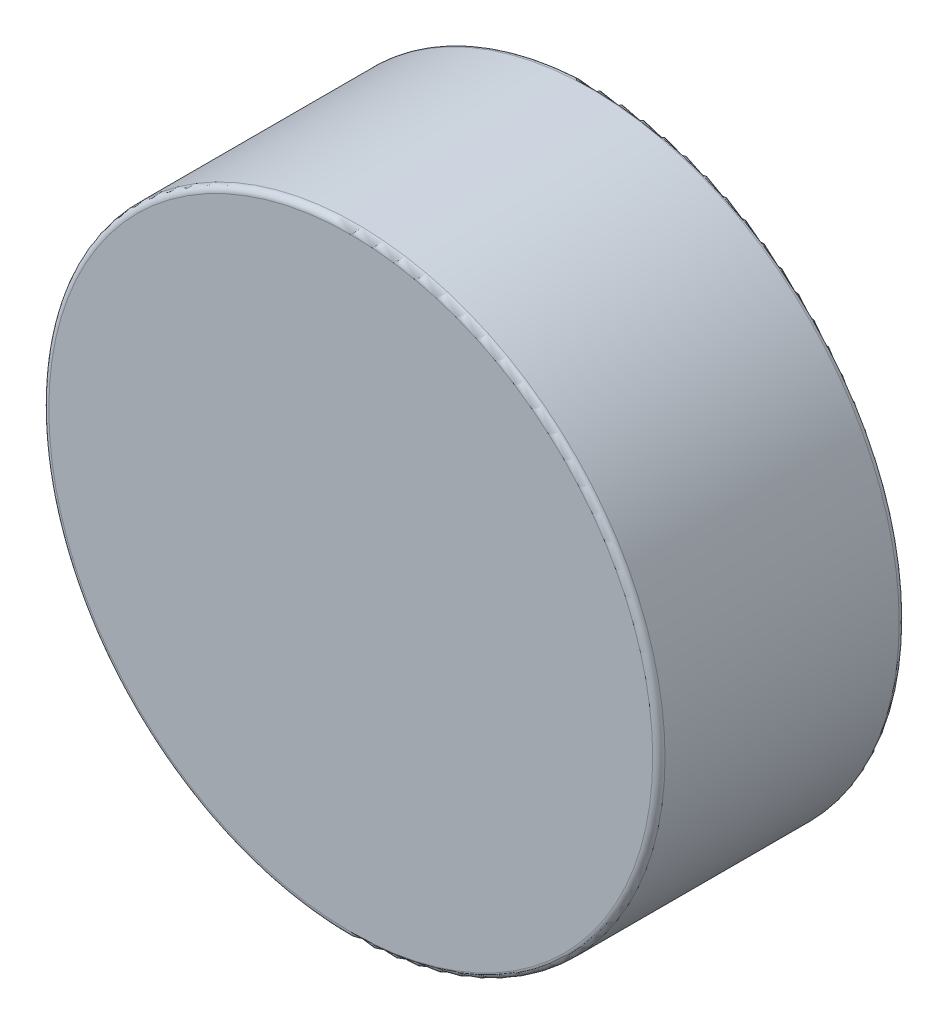
ISO-10303-21;
HEADER;
FILE_DESCRIPTION(('STEP AP214'),'2;1');
FILE_NAME('part.step','',(''),(''),'','','');
FILE_SCHEMA(('AUTOMOTIVE_DESIGN { 1 0 10303 214 1 1 1 1 }'));
ENDSEC;
DATA;
#1=APPLICATION_CONTEXT('core data for automotive mechanical design processes');
#2=APPLICATION_PROTOCOL_DEFINITION('international standard','automotive_design',2000,#1);
#3=PRODUCT_CONTEXT('',#1,'mechanical');
#4=PRODUCT('Part','Part','',(#3));
#5=PRODUCT_RELATED_PRODUCT_CATEGORY('part','',(#4));
#6=PRODUCT_DEFINITION_FORMATION('','',#4);
#7=PRODUCT_DEFINITION_CONTEXT('part definition',#1,'design');
#8=PRODUCT_DEFINITION('design','',#6,#7);
#9=PRODUCT_DEFINITION_SHAPE('','',#8);
#10=(LENGTH_UNIT() NAMED_UNIT(*) SI_UNIT(.MILLI.,.METRE.));
#11=(NAMED_UNIT(*) PLANE_ANGLE_UNIT() SI_UNIT($,.RADIAN.));
#12=(NAMED_UNIT(*) SI_UNIT($,.STERADIAN.) SOLID_ANGLE_UNIT());
#13=UNCERTAINTY_MEASURE_WITH_UNIT(LENGTH_MEASURE(1.E-05),#10,'distance_accuracy_value','');
#14=(GEOMETRIC_REPRESENTATION_CONTEXT(3) GLOBAL_UNCERTAINTY_ASSIGNED_CONTEXT((#13)) GLOBAL_UNIT_ASSIGNED_CONTEXT((#10,
#11,#12)) REPRESENTATION_CONTEXT('',''));
#15=CARTESIAN_POINT('',(0.,0.,0.));
#16=DIRECTION('',(0.,0.,1.));
#17=DIRECTION('',(1.,0.,0.));
#18=AXIS2_PLACEMENT_3D('',#15,#16,#17);
#19=CARTESIAN_POINT('',(0.,0.,1.27));
#20=DIRECTION('',(0.,0.,-1.));
#21=DIRECTION('',(-1.,0.,0.));
#22=AXIS2_PLACEMENT_3D('',#19,#20,#21);
#23=CYLINDRICAL_SURFACE('',#22,3.175);
#24=CARTESIAN_POINT('',(0.,0.,-1.2065));
#25=DIRECTION('',(0.,0.,1.));
#26=DIRECTION('',(1.,0.,0.));
#27=AXIS2_PLACEMENT_3D('',#24,#25,#26);
#28=CIRCLE('',#27,3.175);
#29=CARTESIAN_POINT('',(3.175,0.,-1.2065));
#30=VERTEX_POINT('',#29);
#31=EDGE_CURVE('E52',#30,#30,#28,.T.);
#32=ORIENTED_EDGE('',*,*,#31,.T.);
#33=EDGE_LOOP('',(#32));
#34=FACE_BOUND('',#33,.T.);
#35=CARTESIAN_POINT('',(0.,0.,1.2065));
#36=DIRECTION('',(0.,0.,1.));
#37=DIRECTION('',(1.,0.,0.));
#38=AXIS2_PLACEMENT_3D('',#35,#36,#37);
#39=CIRCLE('',#38,3.175);
#40=CARTESIAN_POINT('',(3.175,0.,1.2065));
#41=VERTEX_POINT('',#40);
#42=EDGE_CURVE('E57',#41,#41,#39,.F.);
#43=ORIENTED_EDGE('',*,*,#42,.T.);
#44=EDGE_LOOP('',(#43));
#45=FACE_BOUND('',#44,.T.);
#46=ADVANCED_FACE('F39',(#34,#45),#23,.T.);
#47=CARTESIAN_POINT('',(0.,0.,1.27));
#48=DIRECTION('',(0.,0.,1.));
#49=DIRECTION('',(1.,0.,0.));
#50=AXIS2_PLACEMENT_3D('',#47,#48,#49);
#51=PLANE('',#50);
#52=CARTESIAN_POINT('',(0.,0.,1.27));
#53=DIRECTION('',(0.,0.,1.));
#54=DIRECTION('',(1.,0.,0.));
#55=AXIS2_PLACEMENT_3D('',#52,#53,#54);
#56=CIRCLE('',#55,3.1115);
#57=CARTESIAN_POINT('',(3.1115,0.,1.27));
#58=VERTEX_POINT('',#57);
#59=EDGE_CURVE('E10',#58,#58,#56,.T.);
#60=ORIENTED_EDGE('',*,*,#59,.T.);
#61=EDGE_LOOP('',(#60));
#62=FACE_BOUND('',#61,.T.);
#63=ADVANCED_FACE('F74',(#62),#51,.T.);
#64=CARTESIAN_POINT('',(0.,0.,-1.27));
#65=DIRECTION('',(0.,0.,1.));
#66=DIRECTION('',(1.,0.,0.));
#67=AXIS2_PLACEMENT_3D('',#64,#65,#66);
#68=PLANE('',#67);
#69=CARTESIAN_POINT('',(0.,0.,-1.27));
#70=DIRECTION('',(0.,0.,1.));
#71=DIRECTION('',(1.,0.,0.));
#72=AXIS2_PLACEMENT_3D('',#69,#70,#71);
#73=CIRCLE('',#72,3.1115);
#74=CARTESIAN_POINT('',(3.1115,0.,-1.27));
#75=VERTEX_POINT('',#74);
#76=EDGE_CURVE('E47',#75,#75,#73,.F.);
#77=ORIENTED_EDGE('',*,*,#76,.T.);
#78=EDGE_LOOP('',(#77));
#79=FACE_BOUND('',#78,.T.);
#80=ADVANCED_FACE('F71',(#79),#68,.F.);
#81=CARTESIAN_POINT('',(0.,0.,-1.2065));
#82=DIRECTION('',(0.,0.,1.));
#83=DIRECTION('',(1.,0.,0.));
#84=AXIS2_PLACEMENT_3D('',#81,#82,#83);
#85=TOROIDAL_SURFACE('',#84,3.1115,0.0635);
#86=ORIENTED_EDGE('',*,*,#76,.F.);
#87=EDGE_LOOP('',(#86));
#88=FACE_BOUND('',#87,.T.);
#89=ORIENTED_EDGE('',*,*,#31,.F.);
#90=EDGE_LOOP('',(#89));
#91=FACE_BOUND('',#90,.T.);
#92=ADVANCED_FACE('F67',(#88,#91),#85,.T.);
#93=CARTESIAN_POINT('',(0.,0.,1.2065));
#94=DIRECTION('',(0.,0.,1.));
#95=DIRECTION('',(1.,0.,0.));
#96=AXIS2_PLACEMENT_3D('',#93,#94,#95);
#97=TOROIDAL_SURFACE('',#96,3.1115,0.0635);
#98=ORIENTED_EDGE('',*,*,#42,.F.);
#99=EDGE_LOOP('',(#98));
#100=FACE_BOUND('',#99,.T.);
#101=ORIENTED_EDGE('',*,*,#59,.F.);
#102=EDGE_LOOP('',(#101));
#103=FACE_BOUND('',#102,.T.);
#104=ADVANCED_FACE('F41',(#100,#103),#97,.T.);
#105=CLOSED_SHELL('',(#46,#63,#80,#92,#104));
#106=MANIFOLD_SOLID_BREP('B2',#105);
#107=ADVANCED_BREP_SHAPE_REPRESENTATION('',(#18,#106),#14);
#108=SHAPE_DEFINITION_REPRESENTATION(#9,#107);
ENDSEC;
END-ISO-10303-21;
